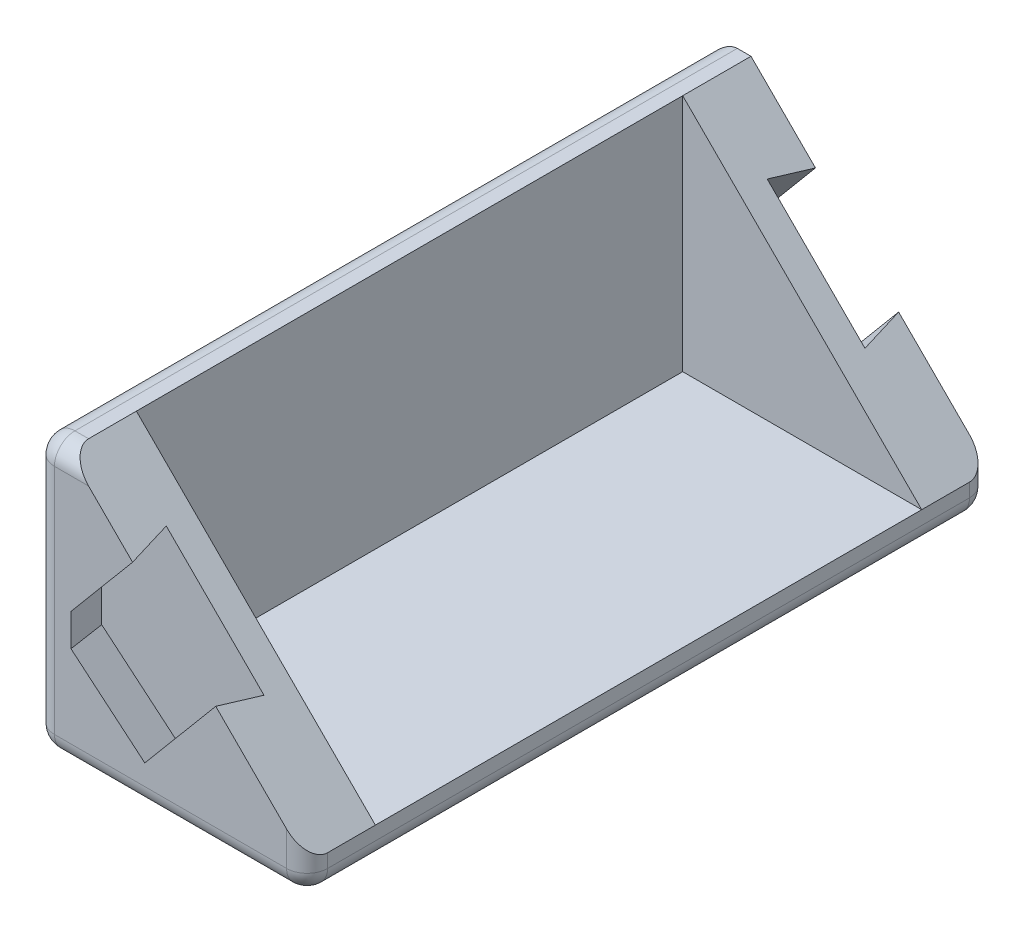
ISO-10303-21;
HEADER;
FILE_DESCRIPTION(('STEP AP214'),'2;1');
FILE_NAME('part.step','',(''),(''),'','','');
FILE_SCHEMA(('AUTOMOTIVE_DESIGN { 1 0 10303 214 1 1 1 1 }'));
ENDSEC;
DATA;
#1=APPLICATION_CONTEXT('core data for automotive mechanical design processes');
#2=APPLICATION_PROTOCOL_DEFINITION('international standard','automotive_design',2000,#1);
#3=PRODUCT_CONTEXT('',#1,'mechanical');
#4=PRODUCT('Part','Part','',(#3));
#5=PRODUCT_RELATED_PRODUCT_CATEGORY('part','',(#4));
#6=PRODUCT_DEFINITION_FORMATION('','',#4);
#7=PRODUCT_DEFINITION_CONTEXT('part definition',#1,'design');
#8=PRODUCT_DEFINITION('design','',#6,#7);
#9=PRODUCT_DEFINITION_SHAPE('','',#8);
#10=(LENGTH_UNIT() NAMED_UNIT(*) SI_UNIT(.MILLI.,.METRE.));
#11=(NAMED_UNIT(*) PLANE_ANGLE_UNIT() SI_UNIT($,.RADIAN.));
#12=(NAMED_UNIT(*) SI_UNIT($,.STERADIAN.) SOLID_ANGLE_UNIT());
#13=UNCERTAINTY_MEASURE_WITH_UNIT(LENGTH_MEASURE(1.E-05),#10,'distance_accuracy_value','');
#14=(GEOMETRIC_REPRESENTATION_CONTEXT(3) GLOBAL_UNCERTAINTY_ASSIGNED_CONTEXT((#13)) GLOBAL_UNIT_ASSIGNED_CONTEXT((#10,
#11,#12)) REPRESENTATION_CONTEXT('',''));
#15=CARTESIAN_POINT('',(0.,0.,0.));
#16=DIRECTION('',(0.,0.,1.));
#17=DIRECTION('',(1.,0.,0.));
#18=AXIS2_PLACEMENT_3D('',#15,#16,#17);
#19=CARTESIAN_POINT('',(0.,0.,-10.));
#20=DIRECTION('',(0.,0.,1.));
#21=DIRECTION('',(1.,0.,0.));
#22=AXIS2_PLACEMENT_3D('',#19,#20,#21);
#23=PLANE('',#22);
#24=DIRECTION('',(0.,-1.,0.));
#25=VECTOR('',#24,1.);
#26=CARTESIAN_POINT('',(-95.,0.,-10.));
#27=LINE('',#26,#25);
#28=CARTESIAN_POINT('',(-95.,-79.1753592594197,-10.));
#29=VERTEX_POINT('',#28);
#30=CARTESIAN_POINT('',(-95.,-114.17535925942,-10.));
#31=VERTEX_POINT('',#30);
#32=EDGE_CURVE('E371',#29,#31,#27,.T.);
#33=ORIENTED_EDGE('',*,*,#32,.F.);
#34=DIRECTION('',(0.707106781186546,-0.707106781186549,0.));
#35=VECTOR('',#34,1.);
#36=CARTESIAN_POINT('',(-87.08767962971,-87.0876796297097,-10.));
#37=LINE('',#36,#35);
#38=CARTESIAN_POINT('',(-60.0000000000002,-114.17535925942,-10.));
#39=VERTEX_POINT('',#38);
#40=EDGE_CURVE('E557',#29,#39,#37,.T.);
#41=ORIENTED_EDGE('',*,*,#40,.T.);
#42=DIRECTION('',(1.,0.,0.));
#43=VECTOR('',#42,1.);
#44=CARTESIAN_POINT('',(0.,-114.17535925942,-10.));
#45=LINE('',#44,#43);
#46=EDGE_CURVE('E232',#31,#39,#45,.T.);
#47=ORIENTED_EDGE('',*,*,#46,.F.);
#48=EDGE_LOOP('',(#33,#41,#47));
#49=FACE_BOUND('',#48,.T.);
#50=ADVANCED_FACE('F55',(#49),#23,.F.);
#51=CARTESIAN_POINT('',(-60.0000000000002,0.,-10.));
#52=DIRECTION('',(-1.,0.,0.));
#53=DIRECTION('',(0.,0.,1.));
#54=AXIS2_PLACEMENT_3D('',#51,#52,#53);
#55=PLANE('',#54);
#56=DIRECTION('',(0.,-1.,0.));
#57=VECTOR('',#56,1.);
#58=CARTESIAN_POINT('',(-60.0000000000002,-119.17535925942,-3.));
#59=LINE('',#58,#57);
#60=CARTESIAN_POINT('',(-60.0000000000002,-114.17535925942,-3.));
#61=VERTEX_POINT('',#60);
#62=CARTESIAN_POINT('',(-60.0000000000002,-116.17535925942,-3.));
#63=VERTEX_POINT('',#62);
#64=EDGE_CURVE('E699',#61,#63,#59,.T.);
#65=ORIENTED_EDGE('',*,*,#64,.T.);
#66=DIRECTION('',(0.,0.,1.));
#67=VECTOR('',#66,1.);
#68=CARTESIAN_POINT('',(-60.0000000000002,-116.17535925942,-97.));
#69=LINE('',#68,#67);
#70=CARTESIAN_POINT('',(-60.0000000000002,-116.17535925942,-97.));
#71=VERTEX_POINT('',#70);
#72=EDGE_CURVE('E650',#63,#71,#69,.F.);
#73=ORIENTED_EDGE('',*,*,#72,.T.);
#74=DIRECTION('',(0.,-1.,0.));
#75=VECTOR('',#74,1.);
#76=CARTESIAN_POINT('',(-60.0000000000002,-114.17535925942,-97.));
#77=LINE('',#76,#75);
#78=CARTESIAN_POINT('',(-60.0000000000002,-114.17535925942,-97.));
#79=VERTEX_POINT('',#78);
#80=EDGE_CURVE('E244',#71,#79,#77,.F.);
#81=ORIENTED_EDGE('',*,*,#80,.T.);
#82=DIRECTION('',(0.,0.,-1.));
#83=VECTOR('',#82,1.);
#84=CARTESIAN_POINT('',(-60.0000000000002,-114.17535925942,-90.));
#85=LINE('',#84,#83);
#86=CARTESIAN_POINT('',(-60.0000000000002,-114.17535925942,-90.));
#87=VERTEX_POINT('',#86);
#88=EDGE_CURVE('E240',#87,#79,#85,.T.);
#89=ORIENTED_EDGE('',*,*,#88,.F.);
#90=DIRECTION('',(0.,0.,1.));
#91=VECTOR('',#90,1.);
#92=CARTESIAN_POINT('',(-60.0000000000002,-114.17535925942,-50.));
#93=LINE('',#92,#91);
#94=EDGE_CURVE('E225',#87,#39,#93,.T.);
#95=ORIENTED_EDGE('',*,*,#94,.T.);
#96=DIRECTION('',(0.,0.,1.));
#97=VECTOR('',#96,1.);
#98=CARTESIAN_POINT('',(-60.0000000000002,-114.17535925942,-10.));
#99=LINE('',#98,#97);
#100=EDGE_CURVE('E561',#39,#61,#99,.T.);
#101=ORIENTED_EDGE('',*,*,#100,.T.);
#102=EDGE_LOOP('',(#65,#73,#81,#89,#95,#101));
#103=FACE_BOUND('',#102,.T.);
#104=ADVANCED_FACE('F242',(#103),#55,.F.);
#105=CARTESIAN_POINT('',(0.,-119.17535925942,-10.));
#106=DIRECTION('',(0.,-1.,0.));
#107=DIRECTION('',(0.,0.,-1.));
#108=AXIS2_PLACEMENT_3D('',#105,#106,#107);
#109=PLANE('',#108);
#110=DIRECTION('',(1.,0.,0.));
#111=VECTOR('',#110,1.);
#112=CARTESIAN_POINT('',(0.,-119.17535925942,-3.));
#113=LINE('',#112,#111);
#114=CARTESIAN_POINT('',(-63.0000000000002,-119.17535925942,-3.));
#115=VERTEX_POINT('',#114);
#116=CARTESIAN_POINT('',(-97.,-119.17535925942,-3.));
#117=VERTEX_POINT('',#116);
#118=EDGE_CURVE('E628',#115,#117,#113,.F.);
#119=ORIENTED_EDGE('',*,*,#118,.T.);
#120=DIRECTION('',(0.,0.,1.));
#121=VECTOR('',#120,1.);
#122=CARTESIAN_POINT('',(-97.,-119.17535925942,-97.));
#123=LINE('',#122,#121);
#124=CARTESIAN_POINT('',(-97.,-119.17535925942,-97.));
#125=VERTEX_POINT('',#124);
#126=EDGE_CURVE('E637',#117,#125,#123,.F.);
#127=ORIENTED_EDGE('',*,*,#126,.T.);
#128=DIRECTION('',(1.,0.,0.));
#129=VECTOR('',#128,1.);
#130=CARTESIAN_POINT('',(0.,-119.17535925942,-97.));
#131=LINE('',#130,#129);
#132=CARTESIAN_POINT('',(-63.0000000000002,-119.17535925942,-97.));
#133=VERTEX_POINT('',#132);
#134=EDGE_CURVE('E634',#125,#133,#131,.T.);
#135=ORIENTED_EDGE('',*,*,#134,.T.);
#136=DIRECTION('',(0.,0.,1.));
#137=VECTOR('',#136,1.);
#138=CARTESIAN_POINT('',(-63.0000000000002,-119.17535925942,-3.));
#139=LINE('',#138,#137);
#140=EDGE_CURVE('E631',#133,#115,#139,.T.);
#141=ORIENTED_EDGE('',*,*,#140,.T.);
#142=EDGE_LOOP('',(#119,#127,#135,#141));
#143=FACE_BOUND('',#142,.T.);
#144=ADVANCED_FACE('F839',(#143),#109,.T.);
#145=CARTESIAN_POINT('',(-100.,0.,-10.));
#146=DIRECTION('',(1.,0.,0.));
#147=DIRECTION('',(0.,0.,-1.));
#148=AXIS2_PLACEMENT_3D('',#145,#146,#147);
#149=PLANE('',#148);
#150=DIRECTION('',(0.,1.,0.));
#151=VECTOR('',#150,1.);
#152=CARTESIAN_POINT('',(-100.,-119.17535925942,-97.));
#153=LINE('',#152,#151);
#154=CARTESIAN_POINT('',(-100.,-82.1753592594197,-97.));
#155=VERTEX_POINT('',#154);
#156=CARTESIAN_POINT('',(-100.,-116.17535925942,-97.));
#157=VERTEX_POINT('',#156);
#158=EDGE_CURVE('E596',#155,#157,#153,.F.);
#159=ORIENTED_EDGE('',*,*,#158,.T.);
#160=DIRECTION('',(0.,0.,1.));
#161=VECTOR('',#160,1.);
#162=CARTESIAN_POINT('',(-100.,-116.17535925942,-3.));
#163=LINE('',#162,#161);
#164=CARTESIAN_POINT('',(-100.,-116.17535925942,-3.));
#165=VERTEX_POINT('',#164);
#166=EDGE_CURVE('E625',#157,#165,#163,.T.);
#167=ORIENTED_EDGE('',*,*,#166,.T.);
#168=DIRECTION('',(0.,1.,0.));
#169=VECTOR('',#168,1.);
#170=CARTESIAN_POINT('',(-100.,-79.1753592594197,-3.));
#171=LINE('',#170,#169);
#172=CARTESIAN_POINT('',(-100.,-82.1753592594197,-3.));
#173=VERTEX_POINT('',#172);
#174=EDGE_CURVE('E593',#165,#173,#171,.T.);
#175=ORIENTED_EDGE('',*,*,#174,.T.);
#176=DIRECTION('',(0.,0.,1.));
#177=VECTOR('',#176,1.);
#178=CARTESIAN_POINT('',(-100.,-82.1753592594197,-10.));
#179=LINE('',#178,#177);
#180=EDGE_CURVE('E590',#173,#155,#179,.F.);
#181=ORIENTED_EDGE('',*,*,#180,.T.);
#182=EDGE_LOOP('',(#159,#167,#175,#181));
#183=FACE_BOUND('',#182,.T.);
#184=ADVANCED_FACE('F867',(#183),#149,.F.);
#185=CARTESIAN_POINT('',(0.,-79.1753592594197,-10.));
#186=DIRECTION('',(0.,-1.,0.));
#187=DIRECTION('',(0.,0.,-1.));
#188=AXIS2_PLACEMENT_3D('',#185,#186,#187);
#189=PLANE('',#188);
#190=DIRECTION('',(1.,0.,0.));
#191=VECTOR('',#190,1.);
#192=CARTESIAN_POINT('',(0.,-79.1753592594197,-100.));
#193=LINE('',#192,#191);
#194=CARTESIAN_POINT('',(-97.,-79.1753592594197,-100.));
#195=VERTEX_POINT('',#194);
#196=CARTESIAN_POINT('',(-95.,-79.1753592594197,-100.));
#197=VERTEX_POINT('',#196);
#198=EDGE_CURVE('E259',#195,#197,#193,.T.);
#199=ORIENTED_EDGE('',*,*,#198,.F.);
#200=DIRECTION('',(0.,0.,1.));
#201=VECTOR('',#200,1.);
#202=CARTESIAN_POINT('',(-97.,-79.1753592594197,-10.));
#203=LINE('',#202,#201);
#204=CARTESIAN_POINT('',(-97.,-79.1753592594197,-3.));
#205=VERTEX_POINT('',#204);
#206=EDGE_CURVE('E603',#195,#205,#203,.T.);
#207=ORIENTED_EDGE('',*,*,#206,.T.);
#208=DIRECTION('',(1.,0.,0.));
#209=VECTOR('',#208,1.);
#210=CARTESIAN_POINT('',(-95.,-79.1753592594197,-3.));
#211=LINE('',#210,#209);
#212=CARTESIAN_POINT('',(-95.,-79.1753592594197,-3.));
#213=VERTEX_POINT('',#212);
#214=EDGE_CURVE('E600',#205,#213,#211,.T.);
#215=ORIENTED_EDGE('',*,*,#214,.T.);
#216=DIRECTION('',(0.,0.,1.));
#217=VECTOR('',#216,1.);
#218=CARTESIAN_POINT('',(-95.,-79.1753592594197,-10.));
#219=LINE('',#218,#217);
#220=EDGE_CURVE('E567',#29,#213,#219,.T.);
#221=ORIENTED_EDGE('',*,*,#220,.F.);
#222=DIRECTION('',(0.,0.,1.));
#223=VECTOR('',#222,1.);
#224=CARTESIAN_POINT('',(-95.,-79.1753592594197,-50.));
#225=LINE('',#224,#223);
#226=CARTESIAN_POINT('',(-95.,-79.1753592594197,-90.));
#227=VERTEX_POINT('',#226);
#228=EDGE_CURVE('E237',#227,#29,#225,.T.);
#229=ORIENTED_EDGE('',*,*,#228,.F.);
#230=DIRECTION('',(0.,0.,-1.));
#231=VECTOR('',#230,1.);
#232=CARTESIAN_POINT('',(-95.,-79.1753592594197,-90.));
#233=LINE('',#232,#231);
#234=EDGE_CURVE('E248',#227,#197,#233,.T.);
#235=ORIENTED_EDGE('',*,*,#234,.T.);
#236=EDGE_LOOP('',(#199,#207,#215,#221,#229,#235));
#237=FACE_BOUND('',#236,.T.);
#238=ADVANCED_FACE('F718',(#237),#189,.F.);
#239=CARTESIAN_POINT('',(-87.08767962971,-87.0876796297097,-10.));
#240=DIRECTION('',(-0.707106781186549,-0.707106781186546,0.));
#241=DIRECTION('',(0.707106781186546,-0.707106781186549,0.));
#242=AXIS2_PLACEMENT_3D('',#239,#240,#241);
#243=PLANE('',#242);
#244=DIRECTION('',(0.707106781186546,-0.707106781186549,0.));
#245=VECTOR('',#244,1.);
#246=CARTESIAN_POINT('',(-87.08767962971,-87.0876796297097,0.));
#247=LINE('',#246,#245);
#248=CARTESIAN_POINT('',(-73.3783438833581,-100.797015376062,0.));
#249=VERTEX_POINT('',#248);
#250=CARTESIAN_POINT('',(-63.0000000000002,-111.17535925942,0.));
#251=VERTEX_POINT('',#250);
#252=EDGE_CURVE('E554',#249,#251,#247,.T.);
#253=ORIENTED_EDGE('',*,*,#252,.T.);
#254=CARTESIAN_POINT('',(-63.0000000000002,-111.17535925942,-3.));
#255=DIRECTION('',(-0.707106781186549,-0.707106781186546,0.));
#256=DIRECTION('',(-0.707106781186546,0.707106781186549,0.));
#257=AXIS2_PLACEMENT_3D('',#254,#255,#256);
#258=ELLIPSE('',#257,4.24264068711929,3.);
#259=EDGE_CURVE('E587',#251,#61,#258,.F.);
#260=ORIENTED_EDGE('',*,*,#259,.T.);
#261=ORIENTED_EDGE('',*,*,#100,.F.);
#262=ORIENTED_EDGE('',*,*,#40,.F.);
#263=ORIENTED_EDGE('',*,*,#220,.T.);
#264=CARTESIAN_POINT('',(-92.,-82.1753592594197,-3.));
#265=DIRECTION('',(-0.707106781186549,-0.707106781186546,0.));
#266=DIRECTION('',(-0.707106781186546,0.707106781186549,0.));
#267=AXIS2_PLACEMENT_3D('',#264,#265,#266);
#268=ELLIPSE('',#267,4.24264068711928,3.);
#269=CARTESIAN_POINT('',(-92.,-82.1753592594197,0.));
#270=VERTEX_POINT('',#269);
#271=EDGE_CURVE('E584',#213,#270,#268,.F.);
#272=ORIENTED_EDGE('',*,*,#271,.T.);
#273=CARTESIAN_POINT('',(-85.5586459753106,-88.6167132841092,0.));
#274=VERTEX_POINT('',#273);
#275=EDGE_CURVE('E562',#270,#274,#247,.T.);
#276=ORIENTED_EDGE('',*,*,#275,.T.);
#277=DIRECTION('',(-0.172114938779374,0.172114938779375,-0.969924170076169));
#278=VECTOR('',#277,1.);
#279=CARTESIAN_POINT('',(-87.3186211832471,-86.8567380761727,-9.91803794033605));
#280=LINE('',#279,#278);
#281=CARTESIAN_POINT('',(-86.6233576966354,-87.5520015627843,-6.));
#282=VERTEX_POINT('',#281);
#283=EDGE_CURVE('E548',#274,#282,#280,.T.);
#284=ORIENTED_EDGE('',*,*,#283,.T.);
#285=DIRECTION('',(-0.707106781186546,0.707106781186549,0.));
#286=VECTOR('',#285,1.);
#287=CARTESIAN_POINT('',(-87.08767962971,-87.0876796297097,-6.));
#288=LINE('',#287,#286);
#289=CARTESIAN_POINT('',(-72.3136321620333,-101.861727097386,-6.));
#290=VERTEX_POINT('',#289);
#291=EDGE_CURVE('E705',#290,#282,#288,.T.);
#292=ORIENTED_EDGE('',*,*,#291,.F.);
#293=DIRECTION('',(-0.172114938779375,0.172114938779376,0.969924170076168));
#294=VECTOR('',#293,1.);
#295=CARTESIAN_POINT('',(-72.5211979367011,-101.654161322719,-4.83029873433046));
#296=LINE('',#295,#294);
#297=EDGE_CURVE('E544',#290,#249,#296,.T.);
#298=ORIENTED_EDGE('',*,*,#297,.T.);
#299=EDGE_LOOP('',(#253,#260,#261,#262,#263,#272,#276,#284,#292,#298));
#300=FACE_BOUND('',#299,.T.);
#301=ADVANCED_FACE('F725',(#300),#243,.F.);
#302=CARTESIAN_POINT('',(0.,0.,0.));
#303=DIRECTION('',(0.,0.,1.));
#304=DIRECTION('',(1.,0.,0.));
#305=AXIS2_PLACEMENT_3D('',#302,#303,#304);
#306=PLANE('',#305);
#307=DIRECTION('',(0.,1.,0.));
#308=VECTOR('',#307,1.);
#309=CARTESIAN_POINT('',(-97.,-119.17535925942,0.));
#310=LINE('',#309,#308);
#311=CARTESIAN_POINT('',(-97.,-82.1753592594197,0.));
#312=VERTEX_POINT('',#311);
#313=CARTESIAN_POINT('',(-97.,-116.17535925942,0.));
#314=VERTEX_POINT('',#313);
#315=EDGE_CURVE('E578',#312,#314,#310,.F.);
#316=ORIENTED_EDGE('',*,*,#315,.T.);
#317=DIRECTION('',(1.,0.,0.));
#318=VECTOR('',#317,1.);
#319=CARTESIAN_POINT('',(0.,-116.17535925942,0.));
#320=LINE('',#319,#318);
#321=CARTESIAN_POINT('',(-63.0000000000002,-116.17535925942,0.));
#322=VERTEX_POINT('',#321);
#323=EDGE_CURVE('E12',#314,#322,#320,.T.);
#324=ORIENTED_EDGE('',*,*,#323,.T.);
#325=DIRECTION('',(0.,-1.,0.));
#326=VECTOR('',#325,1.);
#327=CARTESIAN_POINT('',(-63.0000000000002,-114.17535925942,0.));
#328=LINE('',#327,#326);
#329=EDGE_CURVE('E581',#322,#251,#328,.F.);
#330=ORIENTED_EDGE('',*,*,#329,.T.);
#331=ORIENTED_EDGE('',*,*,#252,.F.);
#332=DIRECTION('',(0.642787609686544,0.766044443118975,0.));
#333=VECTOR('',#332,1.);
#334=CARTESIAN_POINT('',(6.57266132195838,-5.51511769110851,0.));
#335=LINE('',#334,#333);
#336=CARTESIAN_POINT('',(-83.7645532854487,-113.174817744439,0.));
#337=VERTEX_POINT('',#336);
#338=EDGE_CURVE('E730',#337,#249,#335,.T.);
#339=ORIENTED_EDGE('',*,*,#338,.F.);
#340=DIRECTION('',(-0.766044443118975,0.642787609686543,0.));
#341=VECTOR('',#340,1.);
#342=CARTESIAN_POINT('',(-90.337214607407,-107.65970005333,0.));
#343=LINE('',#342,#341);
#344=CARTESIAN_POINT('',(-94.58,-104.099580395241,0.));
#345=VERTEX_POINT('',#344);
#346=EDGE_CURVE('E812',#337,#345,#343,.T.);
#347=ORIENTED_EDGE('',*,*,#346,.T.);
#348=DIRECTION('',(0.,1.,0.));
#349=VECTOR('',#348,1.);
#350=CARTESIAN_POINT('',(-94.5800000000003,-2.77401127046176E-13,0.));
#351=LINE('',#350,#349);
#352=CARTESIAN_POINT('',(-94.58,-99.3679443530969,0.));
#353=VERTEX_POINT('',#352);
#354=EDGE_CURVE('E522',#345,#353,#351,.T.);
#355=ORIENTED_EDGE('',*,*,#354,.T.);
#356=DIRECTION('',(0.642787609686544,0.766044443118974,0.));
#357=VECTOR('',#356,1.);
#358=CARTESIAN_POINT('',(-6.57266132196076,5.51511769111051,0.));
#359=LINE('',#358,#357);
#360=EDGE_CURVE('E549',#353,#274,#359,.T.);
#361=ORIENTED_EDGE('',*,*,#360,.T.);
#362=ORIENTED_EDGE('',*,*,#275,.F.);
#363=DIRECTION('',(1.,0.,0.));
#364=VECTOR('',#363,1.);
#365=CARTESIAN_POINT('',(-100.,-82.1753592594197,0.));
#366=LINE('',#365,#364);
#367=EDGE_CURVE('E575',#270,#312,#366,.F.);
#368=ORIENTED_EDGE('',*,*,#367,.T.);
#369=EDGE_LOOP('',(#316,#324,#330,#331,#339,#347,#355,#361,#362,#368));
#370=FACE_BOUND('',#369,.T.);
#371=ADVANCED_FACE('F759',(#370),#306,.T.);
#372=CARTESIAN_POINT('',(0.,0.,-6.));
#373=DIRECTION('',(0.,0.,1.));
#374=DIRECTION('',(1.,0.,0.));
#375=AXIS2_PLACEMENT_3D('',#372,#373,#374);
#376=PLANE('',#375);
#377=ORIENTED_EDGE('',*,*,#291,.T.);
#378=DIRECTION('',(0.642787609686527,0.766044443118989,0.));
#379=VECTOR('',#378,1.);
#380=CARTESIAN_POINT('',(-7.72172798664173,6.47929910564214,-6.));
#381=LINE('',#380,#379);
#382=CARTESIAN_POINT('',(-96.08,-98.8219890016976,-6.));
#383=VERTEX_POINT('',#382);
#384=EDGE_CURVE('E476',#383,#282,#381,.T.);
#385=ORIENTED_EDGE('',*,*,#384,.F.);
#386=DIRECTION('',(0.,1.,0.));
#387=VECTOR('',#386,1.);
#388=CARTESIAN_POINT('',(-96.08,0.,-6.));
#389=LINE('',#388,#387);
#390=CARTESIAN_POINT('',(-96.08,-104.799041882474,-6.));
#391=VERTEX_POINT('',#390);
#392=EDGE_CURVE('E470',#391,#383,#389,.T.);
#393=ORIENTED_EDGE('',*,*,#392,.F.);
#394=DIRECTION('',(-0.766044443118869,0.642787609686669,0.));
#395=VECTOR('',#394,1.);
#396=CARTESIAN_POINT('',(-91.3013960219553,-108.808766717995,-6.));
#397=LINE('',#396,#395);
#398=CARTESIAN_POINT('',(-83.5796680353017,-115.288065823649,-6.));
#399=VERTEX_POINT('',#398);
#400=EDGE_CURVE('E739',#399,#391,#397,.T.);
#401=ORIENTED_EDGE('',*,*,#400,.F.);
#402=DIRECTION('',(-0.642787609686543,-0.766044443118975,0.));
#403=VECTOR('',#402,1.);
#404=CARTESIAN_POINT('',(7.72172798663679,-6.47929910563828,-6.));
#405=LINE('',#404,#403);
#406=EDGE_CURVE('E540',#290,#399,#405,.T.);
#407=ORIENTED_EDGE('',*,*,#406,.F.);
#408=EDGE_LOOP('',(#377,#385,#393,#401,#407));
#409=FACE_BOUND('',#408,.T.);
#410=ADVANCED_FACE('F495',(#409),#376,.T.);
#411=CARTESIAN_POINT('',(-6.18603418537483,5.19069900339812,2.01882352941175));
#412=DIRECTION('',(-0.74317227126988,0.623595578723745,0.242535625036333));
#413=DIRECTION('',(-0.642787609686544,-0.766044443118974,0.));
#414=AXIS2_PLACEMENT_3D('',#411,#412,#413);
#415=PLANE('',#414);
#416=ORIENTED_EDGE('',*,*,#360,.F.);
#417=DIRECTION('',(0.241596119887387,-0.0879337963532224,0.966384479549557));
#418=VECTOR('',#417,1.);
#419=CARTESIAN_POINT('',(-96.08,-98.8219890016976,-6.));
#420=LINE('',#419,#418);
#421=EDGE_CURVE('E482',#383,#353,#420,.T.);
#422=ORIENTED_EDGE('',*,*,#421,.F.);
#423=ORIENTED_EDGE('',*,*,#384,.T.);
#424=ORIENTED_EDGE('',*,*,#283,.F.);
#425=EDGE_LOOP('',(#416,#422,#423,#424));
#426=FACE_BOUND('',#425,.T.);
#427=ADVANCED_FACE('F484',(#426),#415,.F.);
#428=CARTESIAN_POINT('',(6.18603418537258,-5.19069900339624,2.01882352941103));
#429=DIRECTION('',(0.74317227126988,-0.623595578723745,0.242535625036334));
#430=DIRECTION('',(0.642787609686544,0.766044443118975,0.));
#431=AXIS2_PLACEMENT_3D('',#428,#429,#430);
#432=PLANE('',#431);
#433=ORIENTED_EDGE('',*,*,#406,.T.);
#434=DIRECTION('',(-0.0290519142489422,0.332064899364209,0.942809041581968));
#435=VECTOR('',#434,1.);
#436=CARTESIAN_POINT('',(-83.5796680353017,-115.288065823649,-6.));
#437=LINE('',#436,#435);
#438=EDGE_CURVE('E513',#399,#337,#437,.T.);
#439=ORIENTED_EDGE('',*,*,#438,.T.);
#440=ORIENTED_EDGE('',*,*,#338,.T.);
#441=ORIENTED_EDGE('',*,*,#297,.F.);
#442=EDGE_LOOP('',(#433,#439,#440,#441));
#443=FACE_BOUND('',#442,.T.);
#444=ADVANCED_FACE('F494',(#443),#432,.F.);
#445=CARTESIAN_POINT('',(-89.0164705882355,-2.61083413690519E-13,22.2541176470589));
#446=DIRECTION('',(-0.970142500145332,0.,0.242535625036333));
#447=DIRECTION('',(0.242535625036333,0.,0.970142500145332));
#448=AXIS2_PLACEMENT_3D('',#445,#446,#447);
#449=PLANE('',#448);
#450=DIRECTION('',(0.240999241199596,0.11237979178092,0.963996964798384));
#451=VECTOR('',#450,1.);
#452=CARTESIAN_POINT('',(-96.08,-104.799041882474,-6.));
#453=LINE('',#452,#451);
#454=EDGE_CURVE('E792',#391,#345,#453,.T.);
#455=ORIENTED_EDGE('',*,*,#454,.F.);
#456=ORIENTED_EDGE('',*,*,#392,.T.);
#457=ORIENTED_EDGE('',*,*,#421,.T.);
#458=ORIENTED_EDGE('',*,*,#354,.F.);
#459=EDGE_LOOP('',(#455,#456,#457,#458));
#460=FACE_BOUND('',#459,.T.);
#461=ADVANCED_FACE('F496',(#460),#449,.F.);
#462=CARTESIAN_POINT('',(-85.0232608069532,-101.32677652076,33.0681781687456));
#463=DIRECTION('',(-0.623595578723678,-0.743172271269802,0.242535625036745));
#464=DIRECTION('',(0.766044443118975,-0.642787609686543,0.));
#465=AXIS2_PLACEMENT_3D('',#462,#463,#464);
#466=PLANE('',#465);
#467=ORIENTED_EDGE('',*,*,#438,.F.);
#468=ORIENTED_EDGE('',*,*,#400,.T.);
#469=ORIENTED_EDGE('',*,*,#454,.T.);
#470=ORIENTED_EDGE('',*,*,#346,.F.);
#471=EDGE_LOOP('',(#467,#468,#469,#470));
#472=FACE_BOUND('',#471,.T.);
#473=ADVANCED_FACE('F499',(#472),#466,.F.);
#474=CARTESIAN_POINT('',(-95.,0.,-50.));
#475=DIRECTION('',(-1.,0.,0.));
#476=DIRECTION('',(0.,0.,1.));
#477=AXIS2_PLACEMENT_3D('',#474,#475,#476);
#478=PLANE('',#477);
#479=ORIENTED_EDGE('',*,*,#32,.T.);
#480=DIRECTION('',(0.,0.,1.));
#481=VECTOR('',#480,1.);
#482=CARTESIAN_POINT('',(-95.,-114.17535925942,-50.));
#483=LINE('',#482,#481);
#484=CARTESIAN_POINT('',(-95.,-114.17535925942,-90.));
#485=VERTEX_POINT('',#484);
#486=EDGE_CURVE('E236',#485,#31,#483,.T.);
#487=ORIENTED_EDGE('',*,*,#486,.F.);
#488=DIRECTION('',(0.,-1.,0.));
#489=VECTOR('',#488,1.);
#490=CARTESIAN_POINT('',(-95.,0.,-90.));
#491=LINE('',#490,#489);
#492=EDGE_CURVE('E262',#227,#485,#491,.T.);
#493=ORIENTED_EDGE('',*,*,#492,.F.);
#494=ORIENTED_EDGE('',*,*,#228,.T.);
#495=EDGE_LOOP('',(#479,#487,#493,#494));
#496=FACE_BOUND('',#495,.T.);
#497=ADVANCED_FACE('F503',(#496),#478,.F.);
#498=CARTESIAN_POINT('',(0.,-114.17535925942,-50.));
#499=DIRECTION('',(0.,-1.,0.));
#500=DIRECTION('',(0.,0.,-1.));
#501=AXIS2_PLACEMENT_3D('',#498,#499,#500);
#502=PLANE('',#501);
#503=ORIENTED_EDGE('',*,*,#46,.T.);
#504=ORIENTED_EDGE('',*,*,#94,.F.);
#505=DIRECTION('',(1.,0.,0.));
#506=VECTOR('',#505,1.);
#507=CARTESIAN_POINT('',(0.,-114.17535925942,-90.));
#508=LINE('',#507,#506);
#509=EDGE_CURVE('E230',#485,#87,#508,.T.);
#510=ORIENTED_EDGE('',*,*,#509,.F.);
#511=ORIENTED_EDGE('',*,*,#486,.T.);
#512=EDGE_LOOP('',(#503,#504,#510,#511));
#513=FACE_BOUND('',#512,.T.);
#514=ADVANCED_FACE('F227',(#513),#502,.F.);
#515=CARTESIAN_POINT('',(0.,0.,-90.));
#516=DIRECTION('',(0.,0.,-1.));
#517=DIRECTION('',(1.,0.,0.));
#518=AXIS2_PLACEMENT_3D('',#515,#516,#517);
#519=PLANE('',#518);
#520=ORIENTED_EDGE('',*,*,#492,.T.);
#521=ORIENTED_EDGE('',*,*,#509,.T.);
#522=DIRECTION('',(0.707106781186546,-0.707106781186549,0.));
#523=VECTOR('',#522,1.);
#524=CARTESIAN_POINT('',(-87.08767962971,-87.0876796297097,-90.));
#525=LINE('',#524,#523);
#526=EDGE_CURVE('E249',#227,#87,#525,.T.);
#527=ORIENTED_EDGE('',*,*,#526,.F.);
#528=EDGE_LOOP('',(#520,#521,#527));
#529=FACE_BOUND('',#528,.T.);
#530=ADVANCED_FACE('F261',(#529),#519,.F.);
#531=CARTESIAN_POINT('',(-87.08767962971,-87.0876796297097,-90.));
#532=DIRECTION('',(-0.707106781186549,-0.707106781186546,0.));
#533=DIRECTION('',(0.707106781186546,-0.707106781186549,0.));
#534=AXIS2_PLACEMENT_3D('',#531,#532,#533);
#535=PLANE('',#534);
#536=ORIENTED_EDGE('',*,*,#88,.T.);
#537=CARTESIAN_POINT('',(-63.0000000000002,-111.17535925942,-97.));
#538=DIRECTION('',(-0.707106781186549,-0.707106781186546,0.));
#539=DIRECTION('',(-0.707106781186546,0.707106781186549,0.));
#540=AXIS2_PLACEMENT_3D('',#537,#538,#539);
#541=ELLIPSE('',#540,4.24264068711929,3.);
#542=CARTESIAN_POINT('',(-63.0000000000002,-111.17535925942,-100.));
#543=VERTEX_POINT('',#542);
#544=EDGE_CURVE('E573',#79,#543,#541,.F.);
#545=ORIENTED_EDGE('',*,*,#544,.T.);
#546=DIRECTION('',(0.707106781186546,-0.707106781186549,0.));
#547=VECTOR('',#546,1.);
#548=CARTESIAN_POINT('',(-87.08767962971,-87.0876796297097,-100.));
#549=LINE('',#548,#547);
#550=CARTESIAN_POINT('',(-73.3783438833581,-100.797015376062,-100.));
#551=VERTEX_POINT('',#550);
#552=EDGE_CURVE('E354',#551,#543,#549,.T.);
#553=ORIENTED_EDGE('',*,*,#552,.F.);
#554=DIRECTION('',(-0.172114938779375,0.172114938779376,-0.969924170076168));
#555=VECTOR('',#554,1.);
#556=CARTESIAN_POINT('',(-72.5211979367011,-101.654161322719,-95.1697012656695));
#557=LINE('',#556,#555);
#558=CARTESIAN_POINT('',(-72.3136321620333,-101.861727097386,-94.));
#559=VERTEX_POINT('',#558);
#560=EDGE_CURVE('E345',#559,#551,#557,.T.);
#561=ORIENTED_EDGE('',*,*,#560,.F.);
#562=DIRECTION('',(-0.707106781186546,0.707106781186549,0.));
#563=VECTOR('',#562,1.);
#564=CARTESIAN_POINT('',(-87.08767962971,-87.0876796297097,-94.));
#565=LINE('',#564,#563);
#566=CARTESIAN_POINT('',(-86.6233576966354,-87.5520015627843,-94.));
#567=VERTEX_POINT('',#566);
#568=EDGE_CURVE('E367',#559,#567,#565,.T.);
#569=ORIENTED_EDGE('',*,*,#568,.T.);
#570=DIRECTION('',(-0.172114938779374,0.172114938779375,0.969924170076169));
#571=VECTOR('',#570,1.);
#572=CARTESIAN_POINT('',(-87.3186211832471,-86.8567380761727,-90.081962059664));
#573=LINE('',#572,#571);
#574=CARTESIAN_POINT('',(-85.5586459753106,-88.6167132841092,-100.));
#575=VERTEX_POINT('',#574);
#576=EDGE_CURVE('E348',#575,#567,#573,.T.);
#577=ORIENTED_EDGE('',*,*,#576,.F.);
#578=EDGE_CURVE('E361',#197,#575,#549,.T.);
#579=ORIENTED_EDGE('',*,*,#578,.F.);
#580=ORIENTED_EDGE('',*,*,#234,.F.);
#581=ORIENTED_EDGE('',*,*,#526,.T.);
#582=EDGE_LOOP('',(#536,#545,#553,#561,#569,#577,#579,#580,#581));
#583=FACE_BOUND('',#582,.T.);
#584=ADVANCED_FACE('F253',(#583),#535,.F.);
#585=CARTESIAN_POINT('',(0.,0.,-100.));
#586=DIRECTION('',(0.,0.,-1.));
#587=DIRECTION('',(1.,0.,0.));
#588=AXIS2_PLACEMENT_3D('',#585,#586,#587);
#589=PLANE('',#588);
#590=DIRECTION('',(0.,-1.,0.));
#591=VECTOR('',#590,1.);
#592=CARTESIAN_POINT('',(-63.0000000000002,-119.17535925942,-100.));
#593=LINE('',#592,#591);
#594=CARTESIAN_POINT('',(-63.0000000000002,-116.17535925942,-100.));
#595=VERTEX_POINT('',#594);
#596=EDGE_CURVE('E695',#543,#595,#593,.T.);
#597=ORIENTED_EDGE('',*,*,#596,.T.);
#598=DIRECTION('',(1.,0.,0.));
#599=VECTOR('',#598,1.);
#600=CARTESIAN_POINT('',(0.,-116.17535925942,-100.));
#601=LINE('',#600,#599);
#602=CARTESIAN_POINT('',(-97.,-116.17535925942,-100.));
#603=VERTEX_POINT('',#602);
#604=EDGE_CURVE('E644',#595,#603,#601,.F.);
#605=ORIENTED_EDGE('',*,*,#604,.T.);
#606=DIRECTION('',(0.,1.,0.));
#607=VECTOR('',#606,1.);
#608=CARTESIAN_POINT('',(-97.,-79.1753592594197,-100.));
#609=LINE('',#608,#607);
#610=EDGE_CURVE('E700',#603,#195,#609,.T.);
#611=ORIENTED_EDGE('',*,*,#610,.T.);
#612=ORIENTED_EDGE('',*,*,#198,.T.);
#613=ORIENTED_EDGE('',*,*,#578,.T.);
#614=DIRECTION('',(0.642787609686544,0.766044443118974,0.));
#615=VECTOR('',#614,1.);
#616=CARTESIAN_POINT('',(-6.57266132196076,5.51511769111051,-100.));
#617=LINE('',#616,#615);
#618=CARTESIAN_POINT('',(-94.58,-99.3679443530969,-100.));
#619=VERTEX_POINT('',#618);
#620=EDGE_CURVE('E349',#619,#575,#617,.T.);
#621=ORIENTED_EDGE('',*,*,#620,.F.);
#622=DIRECTION('',(0.,1.,0.));
#623=VECTOR('',#622,1.);
#624=CARTESIAN_POINT('',(-94.5800000000003,-2.77401127046176E-13,-100.));
#625=LINE('',#624,#623);
#626=CARTESIAN_POINT('',(-94.58,-104.099580395241,-100.));
#627=VERTEX_POINT('',#626);
#628=EDGE_CURVE('E323',#627,#619,#625,.T.);
#629=ORIENTED_EDGE('',*,*,#628,.F.);
#630=DIRECTION('',(-0.766044443118975,0.642787609686543,0.));
#631=VECTOR('',#630,1.);
#632=CARTESIAN_POINT('',(-90.337214607407,-107.65970005333,-100.));
#633=LINE('',#632,#631);
#634=CARTESIAN_POINT('',(-83.7645532854487,-113.174817744439,-100.));
#635=VERTEX_POINT('',#634);
#636=EDGE_CURVE('E446',#635,#627,#633,.T.);
#637=ORIENTED_EDGE('',*,*,#636,.F.);
#638=DIRECTION('',(0.642787609686544,0.766044443118975,0.));
#639=VECTOR('',#638,1.);
#640=CARTESIAN_POINT('',(6.57266132195838,-5.51511769110851,-100.));
#641=LINE('',#640,#639);
#642=EDGE_CURVE('E372',#635,#551,#641,.T.);
#643=ORIENTED_EDGE('',*,*,#642,.T.);
#644=ORIENTED_EDGE('',*,*,#552,.T.);
#645=EDGE_LOOP('',(#597,#605,#611,#612,#613,#621,#629,#637,#643,#644));
#646=FACE_BOUND('',#645,.T.);
#647=ADVANCED_FACE('F396',(#646),#589,.T.);
#648=CARTESIAN_POINT('',(0.,0.,-94.));
#649=DIRECTION('',(0.,0.,-1.));
#650=DIRECTION('',(1.,0.,0.));
#651=AXIS2_PLACEMENT_3D('',#648,#649,#650);
#652=PLANE('',#651);
#653=ORIENTED_EDGE('',*,*,#568,.F.);
#654=DIRECTION('',(-0.642787609686543,-0.766044443118975,0.));
#655=VECTOR('',#654,1.);
#656=CARTESIAN_POINT('',(7.72172798663679,-6.47929910563828,-94.));
#657=LINE('',#656,#655);
#658=CARTESIAN_POINT('',(-83.5796680353017,-115.288065823649,-94.));
#659=VERTEX_POINT('',#658);
#660=EDGE_CURVE('E341',#559,#659,#657,.T.);
#661=ORIENTED_EDGE('',*,*,#660,.T.);
#662=DIRECTION('',(-0.766044443118869,0.642787609686669,0.));
#663=VECTOR('',#662,1.);
#664=CARTESIAN_POINT('',(-91.3013960219553,-108.808766717995,-94.));
#665=LINE('',#664,#663);
#666=CARTESIAN_POINT('',(-96.08,-104.799041882474,-94.));
#667=VERTEX_POINT('',#666);
#668=EDGE_CURVE('E269',#659,#667,#665,.T.);
#669=ORIENTED_EDGE('',*,*,#668,.T.);
#670=DIRECTION('',(0.,1.,0.));
#671=VECTOR('',#670,1.);
#672=CARTESIAN_POINT('',(-96.08,0.,-94.));
#673=LINE('',#672,#671);
#674=CARTESIAN_POINT('',(-96.08,-98.8219890016976,-94.));
#675=VERTEX_POINT('',#674);
#676=EDGE_CURVE('E264',#667,#675,#673,.T.);
#677=ORIENTED_EDGE('',*,*,#676,.T.);
#678=DIRECTION('',(0.642787609686527,0.766044443118989,0.));
#679=VECTOR('',#678,1.);
#680=CARTESIAN_POINT('',(-7.72172798664173,6.47929910564214,-94.));
#681=LINE('',#680,#679);
#682=EDGE_CURVE('E278',#675,#567,#681,.T.);
#683=ORIENTED_EDGE('',*,*,#682,.T.);
#684=EDGE_LOOP('',(#653,#661,#669,#677,#683));
#685=FACE_BOUND('',#684,.T.);
#686=ADVANCED_FACE('F296',(#685),#652,.T.);
#687=CARTESIAN_POINT('',(-6.18603418537483,5.19069900339812,-102.018823529412));
#688=DIRECTION('',(-0.74317227126988,0.623595578723745,-0.242535625036333));
#689=DIRECTION('',(-0.642787609686544,-0.766044443118974,0.));
#690=AXIS2_PLACEMENT_3D('',#687,#688,#689);
#691=PLANE('',#690);
#692=ORIENTED_EDGE('',*,*,#620,.T.);
#693=ORIENTED_EDGE('',*,*,#576,.T.);
#694=ORIENTED_EDGE('',*,*,#682,.F.);
#695=DIRECTION('',(0.241596119887387,-0.0879337963532224,-0.966384479549557));
#696=VECTOR('',#695,1.);
#697=CARTESIAN_POINT('',(-96.08,-98.8219890016976,-94.));
#698=LINE('',#697,#696);
#699=EDGE_CURVE('E283',#675,#619,#698,.T.);
#700=ORIENTED_EDGE('',*,*,#699,.T.);
#701=EDGE_LOOP('',(#692,#693,#694,#700));
#702=FACE_BOUND('',#701,.T.);
#703=ADVANCED_FACE('F285',(#702),#691,.F.);
#704=CARTESIAN_POINT('',(6.18603418537258,-5.19069900339624,-102.018823529411));
#705=DIRECTION('',(0.74317227126988,-0.623595578723745,-0.242535625036334));
#706=DIRECTION('',(0.642787609686544,0.766044443118975,0.));
#707=AXIS2_PLACEMENT_3D('',#704,#705,#706);
#708=PLANE('',#707);
#709=ORIENTED_EDGE('',*,*,#660,.F.);
#710=ORIENTED_EDGE('',*,*,#560,.T.);
#711=ORIENTED_EDGE('',*,*,#642,.F.);
#712=DIRECTION('',(-0.0290519142489422,0.332064899364209,-0.942809041581968));
#713=VECTOR('',#712,1.);
#714=CARTESIAN_POINT('',(-83.5796680353017,-115.288065823649,-94.));
#715=LINE('',#714,#713);
#716=EDGE_CURVE('E315',#659,#635,#715,.T.);
#717=ORIENTED_EDGE('',*,*,#716,.F.);
#718=EDGE_LOOP('',(#709,#710,#711,#717));
#719=FACE_BOUND('',#718,.T.);
#720=ADVANCED_FACE('F295',(#719),#708,.F.);
#721=CARTESIAN_POINT('',(-89.0164705882355,-2.61083413690519E-13,-122.254117647059));
#722=DIRECTION('',(-0.970142500145332,0.,-0.242535625036333));
#723=DIRECTION('',(0.242535625036333,0.,-0.970142500145332));
#724=AXIS2_PLACEMENT_3D('',#721,#722,#723);
#725=PLANE('',#724);
#726=DIRECTION('',(0.240999241199596,0.11237979178092,-0.963996964798384));
#727=VECTOR('',#726,1.);
#728=CARTESIAN_POINT('',(-96.08,-104.799041882474,-94.));
#729=LINE('',#728,#727);
#730=EDGE_CURVE('E424',#667,#627,#729,.T.);
#731=ORIENTED_EDGE('',*,*,#730,.T.);
#732=ORIENTED_EDGE('',*,*,#628,.T.);
#733=ORIENTED_EDGE('',*,*,#699,.F.);
#734=ORIENTED_EDGE('',*,*,#676,.F.);
#735=EDGE_LOOP('',(#731,#732,#733,#734));
#736=FACE_BOUND('',#735,.T.);
#737=ADVANCED_FACE('F297',(#736),#725,.F.);
#738=CARTESIAN_POINT('',(-85.0232608069532,-101.32677652076,-133.068178168746));
#739=DIRECTION('',(-0.623595578723678,-0.743172271269802,-0.242535625036745));
#740=DIRECTION('',(0.766044443118975,-0.642787609686543,0.));
#741=AXIS2_PLACEMENT_3D('',#738,#739,#740);
#742=PLANE('',#741);
#743=ORIENTED_EDGE('',*,*,#716,.T.);
#744=ORIENTED_EDGE('',*,*,#636,.T.);
#745=ORIENTED_EDGE('',*,*,#730,.F.);
#746=ORIENTED_EDGE('',*,*,#668,.F.);
#747=EDGE_LOOP('',(#743,#744,#745,#746));
#748=FACE_BOUND('',#747,.T.);
#749=ADVANCED_FACE('F300',(#748),#742,.F.);
#750=CARTESIAN_POINT('',(-63.0000000000002,0.,-97.));
#751=DIRECTION('',(0.,1.,0.));
#752=DIRECTION('',(0.,0.,1.));
#753=AXIS2_PLACEMENT_3D('',#750,#751,#752);
#754=CYLINDRICAL_SURFACE('',#753,3.);
#755=ORIENTED_EDGE('',*,*,#80,.F.);
#756=CARTESIAN_POINT('',(-63.0000000000002,-116.17535925942,-97.));
#757=DIRECTION('',(0.,1.,0.));
#758=DIRECTION('',(0.,0.,1.));
#759=AXIS2_PLACEMENT_3D('',#756,#757,#758);
#760=CIRCLE('',#759,3.);
#761=EDGE_CURVE('E647',#71,#595,#760,.T.);
#762=ORIENTED_EDGE('',*,*,#761,.T.);
#763=ORIENTED_EDGE('',*,*,#596,.F.);
#764=ORIENTED_EDGE('',*,*,#544,.F.);
#765=EDGE_LOOP('',(#755,#762,#763,#764));
#766=FACE_BOUND('',#765,.T.);
#767=ADVANCED_FACE('F304',(#766),#754,.T.);
#768=CARTESIAN_POINT('',(-63.0000000000002,0.,-3.));
#769=DIRECTION('',(0.,1.,0.));
#770=DIRECTION('',(0.,0.,1.));
#771=AXIS2_PLACEMENT_3D('',#768,#769,#770);
#772=CYLINDRICAL_SURFACE('',#771,3.);
#773=ORIENTED_EDGE('',*,*,#329,.F.);
#774=CARTESIAN_POINT('',(-63.0000000000002,-116.17535925942,-3.));
#775=DIRECTION('',(0.,1.,0.));
#776=DIRECTION('',(0.,0.,1.));
#777=AXIS2_PLACEMENT_3D('',#774,#775,#776);
#778=CIRCLE('',#777,3.);
#779=EDGE_CURVE('E65',#322,#63,#778,.T.);
#780=ORIENTED_EDGE('',*,*,#779,.T.);
#781=ORIENTED_EDGE('',*,*,#64,.F.);
#782=ORIENTED_EDGE('',*,*,#259,.F.);
#783=EDGE_LOOP('',(#773,#780,#781,#782));
#784=FACE_BOUND('',#783,.T.);
#785=ADVANCED_FACE('F829',(#784),#772,.T.);
#786=CARTESIAN_POINT('',(0.,-82.1753592594197,-3.));
#787=DIRECTION('',(-1.,0.,0.));
#788=DIRECTION('',(0.,0.,1.));
#789=AXIS2_PLACEMENT_3D('',#786,#787,#788);
#790=CYLINDRICAL_SURFACE('',#789,3.);
#791=ORIENTED_EDGE('',*,*,#271,.F.);
#792=ORIENTED_EDGE('',*,*,#214,.F.);
#793=CARTESIAN_POINT('',(-97.,-82.1753592594197,-3.));
#794=DIRECTION('',(-1.,0.,0.));
#795=DIRECTION('',(0.,0.,1.));
#796=AXIS2_PLACEMENT_3D('',#793,#794,#795);
#797=CIRCLE('',#796,3.);
#798=EDGE_CURVE('E271',#312,#205,#797,.T.);
#799=ORIENTED_EDGE('',*,*,#798,.F.);
#800=ORIENTED_EDGE('',*,*,#367,.F.);
#801=EDGE_LOOP('',(#791,#792,#799,#800));
#802=FACE_BOUND('',#801,.T.);
#803=ADVANCED_FACE('F879',(#802),#790,.T.);
#804=CARTESIAN_POINT('',(-97.,0.,-3.));
#805=DIRECTION('',(0.,-1.,0.));
#806=DIRECTION('',(0.,0.,-1.));
#807=AXIS2_PLACEMENT_3D('',#804,#805,#806);
#808=CYLINDRICAL_SURFACE('',#807,3.);
#809=ORIENTED_EDGE('',*,*,#174,.F.);
#810=CARTESIAN_POINT('',(-97.,-116.17535925942,-3.));
#811=DIRECTION('',(0.,-1.,0.));
#812=DIRECTION('',(0.,0.,-1.));
#813=AXIS2_PLACEMENT_3D('',#810,#811,#812);
#814=CIRCLE('',#813,3.);
#815=EDGE_CURVE('E606',#165,#314,#814,.F.);
#816=ORIENTED_EDGE('',*,*,#815,.T.);
#817=ORIENTED_EDGE('',*,*,#315,.F.);
#818=CARTESIAN_POINT('',(-97.,-82.1753592594197,-3.));
#819=DIRECTION('',(0.,1.,0.));
#820=DIRECTION('',(0.,0.,1.));
#821=AXIS2_PLACEMENT_3D('',#818,#819,#820);
#822=CIRCLE('',#821,3.);
#823=EDGE_CURVE('E615',#173,#312,#822,.T.);
#824=ORIENTED_EDGE('',*,*,#823,.F.);
#825=EDGE_LOOP('',(#809,#816,#817,#824));
#826=FACE_BOUND('',#825,.T.);
#827=ADVANCED_FACE('F891',(#826),#808,.T.);
#828=CARTESIAN_POINT('',(-97.,-82.1753592594197,-3.));
#829=DIRECTION('',(0.,0.,1.));
#830=DIRECTION('',(1.,0.,0.));
#831=AXIS2_PLACEMENT_3D('',#828,#829,#830);
#832=SPHERICAL_SURFACE('',#831,3.);
#833=ORIENTED_EDGE('',*,*,#823,.T.);
#834=ORIENTED_EDGE('',*,*,#798,.T.);
#835=CARTESIAN_POINT('',(-97.,-82.1753592594197,-3.));
#836=DIRECTION('',(0.,0.,1.));
#837=DIRECTION('',(1.,0.,0.));
#838=AXIS2_PLACEMENT_3D('',#835,#836,#837);
#839=CIRCLE('',#838,3.);
#840=EDGE_CURVE('E611',#173,#205,#839,.F.);
#841=ORIENTED_EDGE('',*,*,#840,.F.);
#842=EDGE_LOOP('',(#833,#834,#841));
#843=FACE_BOUND('',#842,.T.);
#844=ADVANCED_FACE('F887',(#843),#832,.T.);
#845=CARTESIAN_POINT('',(-97.,-82.1753592594197,-10.));
#846=DIRECTION('',(0.,0.,1.));
#847=DIRECTION('',(1.,0.,0.));
#848=AXIS2_PLACEMENT_3D('',#845,#846,#847);
#849=CYLINDRICAL_SURFACE('',#848,3.);
#850=ORIENTED_EDGE('',*,*,#840,.T.);
#851=ORIENTED_EDGE('',*,*,#206,.F.);
#852=CARTESIAN_POINT('',(-97.,-82.1753592594197,-97.));
#853=DIRECTION('',(0.,0.707106781186547,0.707106781186547));
#854=DIRECTION('',(0.,-0.707106781186547,0.707106781186547));
#855=AXIS2_PLACEMENT_3D('',#852,#853,#854);
#856=ELLIPSE('',#855,4.24264068711928,3.);
#857=EDGE_CURVE('E607',#155,#195,#856,.F.);
#858=ORIENTED_EDGE('',*,*,#857,.F.);
#859=ORIENTED_EDGE('',*,*,#180,.F.);
#860=EDGE_LOOP('',(#850,#851,#858,#859));
#861=FACE_BOUND('',#860,.T.);
#862=ADVANCED_FACE('F883',(#861),#849,.T.);
#863=CARTESIAN_POINT('',(-97.,0.,-97.));
#864=DIRECTION('',(0.,-1.,0.));
#865=DIRECTION('',(0.,0.,-1.));
#866=AXIS2_PLACEMENT_3D('',#863,#864,#865);
#867=CYLINDRICAL_SURFACE('',#866,3.);
#868=ORIENTED_EDGE('',*,*,#610,.F.);
#869=CARTESIAN_POINT('',(-97.,-116.17535925942,-97.));
#870=DIRECTION('',(0.,-1.,0.));
#871=DIRECTION('',(0.,0.,-1.));
#872=AXIS2_PLACEMENT_3D('',#869,#870,#871);
#873=CIRCLE('',#872,3.);
#874=EDGE_CURVE('E641',#603,#157,#873,.F.);
#875=ORIENTED_EDGE('',*,*,#874,.T.);
#876=ORIENTED_EDGE('',*,*,#158,.F.);
#877=ORIENTED_EDGE('',*,*,#857,.T.);
#878=EDGE_LOOP('',(#868,#875,#876,#877));
#879=FACE_BOUND('',#878,.T.);
#880=ADVANCED_FACE('F880',(#879),#867,.T.);
#881=CARTESIAN_POINT('',(-63.0000000000002,-116.17535925942,-97.));
#882=DIRECTION('',(0.,-1.,0.));
#883=DIRECTION('',(0.,0.,-1.));
#884=AXIS2_PLACEMENT_3D('',#881,#882,#883);
#885=SPHERICAL_SURFACE('',#884,3.);
#886=CARTESIAN_POINT('',(-63.0000000000002,-116.17535925942,-97.));
#887=DIRECTION('',(-1.,0.,0.));
#888=DIRECTION('',(0.,0.,1.));
#889=AXIS2_PLACEMENT_3D('',#886,#887,#888);
#890=CIRCLE('',#889,3.);
#891=EDGE_CURVE('E676',#595,#133,#890,.T.);
#892=ORIENTED_EDGE('',*,*,#891,.F.);
#893=ORIENTED_EDGE('',*,*,#761,.F.);
#894=CARTESIAN_POINT('',(-63.0000000000002,-116.17535925942,-97.));
#895=DIRECTION('',(0.,0.,1.));
#896=DIRECTION('',(1.,0.,0.));
#897=AXIS2_PLACEMENT_3D('',#894,#895,#896);
#898=CIRCLE('',#897,3.);
#899=EDGE_CURVE('E59',#133,#71,#898,.T.);
#900=ORIENTED_EDGE('',*,*,#899,.F.);
#901=EDGE_LOOP('',(#892,#893,#900));
#902=FACE_BOUND('',#901,.T.);
#903=ADVANCED_FACE('F57',(#902),#885,.T.);
#904=CARTESIAN_POINT('',(-63.0000000000002,-116.17535925942,-10.));
#905=DIRECTION('',(0.,0.,-1.));
#906=DIRECTION('',(-1.,0.,0.));
#907=AXIS2_PLACEMENT_3D('',#904,#905,#906);
#908=CYLINDRICAL_SURFACE('',#907,3.);
#909=ORIENTED_EDGE('',*,*,#899,.T.);
#910=ORIENTED_EDGE('',*,*,#72,.F.);
#911=CARTESIAN_POINT('',(-63.0000000000002,-116.17535925942,-3.));
#912=DIRECTION('',(0.,0.,1.));
#913=DIRECTION('',(1.,0.,0.));
#914=AXIS2_PLACEMENT_3D('',#911,#912,#913);
#915=CIRCLE('',#914,3.);
#916=EDGE_CURVE('E673',#115,#63,#915,.T.);
#917=ORIENTED_EDGE('',*,*,#916,.F.);
#918=ORIENTED_EDGE('',*,*,#140,.F.);
#919=EDGE_LOOP('',(#909,#910,#917,#918));
#920=FACE_BOUND('',#919,.T.);
#921=ADVANCED_FACE('F689',(#920),#908,.T.);
#922=CARTESIAN_POINT('',(0.,-116.17535925942,-97.));
#923=DIRECTION('',(1.,0.,0.));
#924=DIRECTION('',(0.,0.,-1.));
#925=AXIS2_PLACEMENT_3D('',#922,#923,#924);
#926=CYLINDRICAL_SURFACE('',#925,3.);
#927=ORIENTED_EDGE('',*,*,#891,.T.);
#928=ORIENTED_EDGE('',*,*,#134,.F.);
#929=CARTESIAN_POINT('',(-97.,-116.17535925942,-97.));
#930=DIRECTION('',(-1.,0.,0.));
#931=DIRECTION('',(0.,0.,1.));
#932=AXIS2_PLACEMENT_3D('',#929,#930,#931);
#933=CIRCLE('',#932,3.);
#934=EDGE_CURVE('E669',#603,#125,#933,.T.);
#935=ORIENTED_EDGE('',*,*,#934,.F.);
#936=ORIENTED_EDGE('',*,*,#604,.F.);
#937=EDGE_LOOP('',(#927,#928,#935,#936));
#938=FACE_BOUND('',#937,.T.);
#939=ADVANCED_FACE('F849',(#938),#926,.T.);
#940=CARTESIAN_POINT('',(-63.0000000000002,-116.17535925942,-3.));
#941=DIRECTION('',(0.,-1.,0.));
#942=DIRECTION('',(0.,0.,-1.));
#943=AXIS2_PLACEMENT_3D('',#940,#941,#942);
#944=SPHERICAL_SURFACE('',#943,3.);
#945=ORIENTED_EDGE('',*,*,#916,.T.);
#946=ORIENTED_EDGE('',*,*,#779,.F.);
#947=CARTESIAN_POINT('',(-63.0000000000002,-116.17535925942,-3.));
#948=DIRECTION('',(-1.,0.,0.));
#949=DIRECTION('',(0.,0.,1.));
#950=AXIS2_PLACEMENT_3D('',#947,#948,#949);
#951=CIRCLE('',#950,3.);
#952=EDGE_CURVE('E665',#115,#322,#951,.T.);
#953=ORIENTED_EDGE('',*,*,#952,.F.);
#954=EDGE_LOOP('',(#945,#946,#953));
#955=FACE_BOUND('',#954,.T.);
#956=ADVANCED_FACE('F832',(#955),#944,.T.);
#957=CARTESIAN_POINT('',(-97.,-116.17535925942,-97.));
#958=DIRECTION('',(0.,-1.,0.));
#959=DIRECTION('',(0.,0.,-1.));
#960=AXIS2_PLACEMENT_3D('',#957,#958,#959);
#961=SPHERICAL_SURFACE('',#960,3.);
#962=ORIENTED_EDGE('',*,*,#874,.F.);
#963=ORIENTED_EDGE('',*,*,#934,.T.);
#964=CARTESIAN_POINT('',(-97.,-116.17535925942,-97.));
#965=DIRECTION('',(0.,0.,1.));
#966=DIRECTION('',(1.,0.,0.));
#967=AXIS2_PLACEMENT_3D('',#964,#965,#966);
#968=CIRCLE('',#967,3.);
#969=EDGE_CURVE('E662',#157,#125,#968,.T.);
#970=ORIENTED_EDGE('',*,*,#969,.F.);
#971=EDGE_LOOP('',(#962,#963,#970));
#972=FACE_BOUND('',#971,.T.);
#973=ADVANCED_FACE('F848',(#972),#961,.T.);
#974=CARTESIAN_POINT('',(0.,-116.17535925942,-3.));
#975=DIRECTION('',(1.,0.,0.));
#976=DIRECTION('',(0.,0.,-1.));
#977=AXIS2_PLACEMENT_3D('',#974,#975,#976);
#978=CYLINDRICAL_SURFACE('',#977,3.);
#979=ORIENTED_EDGE('',*,*,#952,.T.);
#980=ORIENTED_EDGE('',*,*,#323,.F.);
#981=CARTESIAN_POINT('',(-97.,-116.17535925942,-3.));
#982=DIRECTION('',(-1.,0.,0.));
#983=DIRECTION('',(0.,0.,1.));
#984=AXIS2_PLACEMENT_3D('',#981,#982,#983);
#985=CIRCLE('',#984,3.);
#986=EDGE_CURVE('E659',#117,#314,#985,.T.);
#987=ORIENTED_EDGE('',*,*,#986,.F.);
#988=ORIENTED_EDGE('',*,*,#118,.F.);
#989=EDGE_LOOP('',(#979,#980,#987,#988));
#990=FACE_BOUND('',#989,.T.);
#991=ADVANCED_FACE('F835',(#990),#978,.T.);
#992=CARTESIAN_POINT('',(-97.,-116.17535925942,-10.));
#993=DIRECTION('',(0.,0.,-1.));
#994=DIRECTION('',(-1.,0.,0.));
#995=AXIS2_PLACEMENT_3D('',#992,#993,#994);
#996=CYLINDRICAL_SURFACE('',#995,3.);
#997=ORIENTED_EDGE('',*,*,#969,.T.);
#998=ORIENTED_EDGE('',*,*,#126,.F.);
#999=CARTESIAN_POINT('',(-97.,-116.17535925942,-3.));
#1000=DIRECTION('',(0.,0.,1.));
#1001=DIRECTION('',(1.,0.,0.));
#1002=AXIS2_PLACEMENT_3D('',#999,#1000,#1001);
#1003=CIRCLE('',#1002,3.);
#1004=EDGE_CURVE('E655',#165,#117,#1003,.T.);
#1005=ORIENTED_EDGE('',*,*,#1004,.F.);
#1006=ORIENTED_EDGE('',*,*,#166,.F.);
#1007=EDGE_LOOP('',(#997,#998,#1005,#1006));
#1008=FACE_BOUND('',#1007,.T.);
#1009=ADVANCED_FACE('F842',(#1008),#996,.T.);
#1010=CARTESIAN_POINT('',(-97.,-116.17535925942,-3.));
#1011=DIRECTION('',(0.,-1.,0.));
#1012=DIRECTION('',(0.,0.,-1.));
#1013=AXIS2_PLACEMENT_3D('',#1010,#1011,#1012);
#1014=SPHERICAL_SURFACE('',#1013,3.);
#1015=ORIENTED_EDGE('',*,*,#986,.T.);
#1016=ORIENTED_EDGE('',*,*,#815,.F.);
#1017=ORIENTED_EDGE('',*,*,#1004,.T.);
#1018=EDGE_LOOP('',(#1015,#1016,#1017));
#1019=FACE_BOUND('',#1018,.T.);
#1020=ADVANCED_FACE('F899',(#1019),#1014,.T.);
#1021=CLOSED_SHELL('',(#50,#104,#144,#184,#238,#301,#371,#410,#427,#444,#461,#473,#497,#514,
#530,#584,#647,#686,#703,#720,#737,#749,#767,#785,#803,#827,#844,#862,#880,#903,#921,#939,#956,
#973,#991,#1009,#1020));
#1022=MANIFOLD_SOLID_BREP('B2',#1021);
#1023=ADVANCED_BREP_SHAPE_REPRESENTATION('',(#18,#1022),#14);
#1024=SHAPE_DEFINITION_REPRESENTATION(#9,#1023);
ENDSEC;
END-ISO-10303-21;
